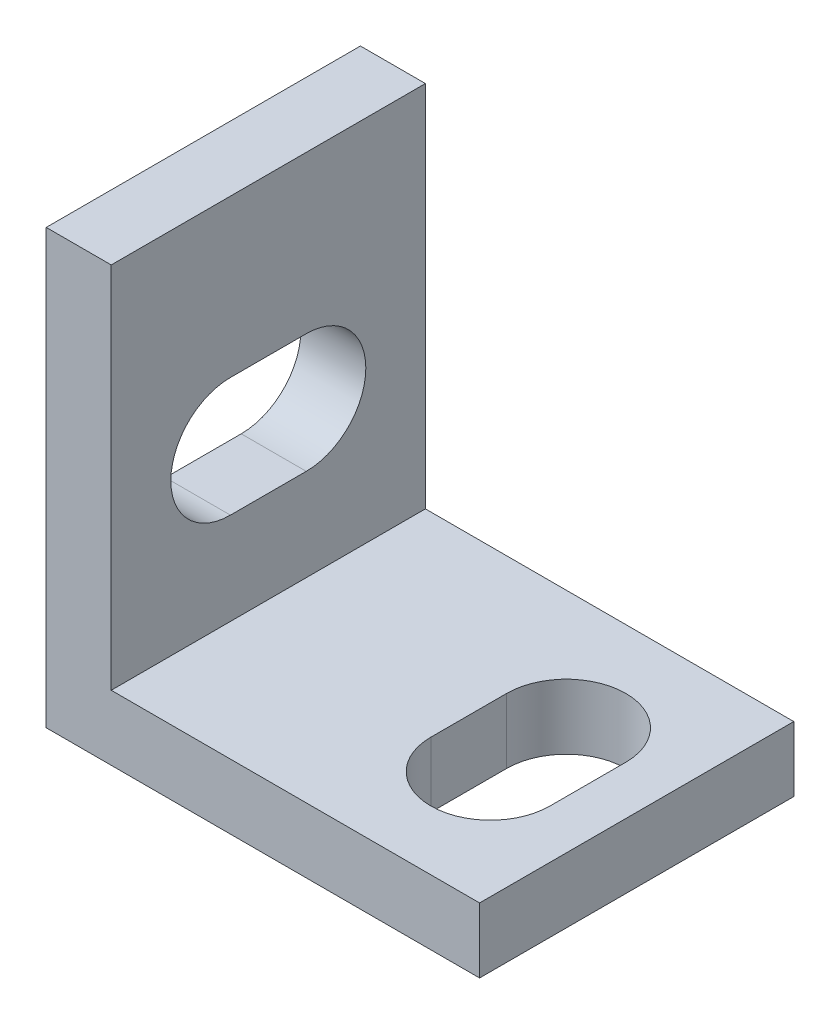
ISO-10303-21;
HEADER;
FILE_DESCRIPTION(('STEP AP214'),'2;1');
FILE_NAME('part.step','',(''),(''),'','','');
FILE_SCHEMA(('AUTOMOTIVE_DESIGN { 1 0 10303 214 1 1 1 1 }'));
ENDSEC;
DATA;
#1=APPLICATION_CONTEXT('core data for automotive mechanical design processes');
#2=APPLICATION_PROTOCOL_DEFINITION('international standard','automotive_design',2000,#1);
#3=PRODUCT_CONTEXT('',#1,'mechanical');
#4=PRODUCT('Part','Part','',(#3));
#5=PRODUCT_RELATED_PRODUCT_CATEGORY('part','',(#4));
#6=PRODUCT_DEFINITION_FORMATION('','',#4);
#7=PRODUCT_DEFINITION_CONTEXT('part definition',#1,'design');
#8=PRODUCT_DEFINITION('design','',#6,#7);
#9=PRODUCT_DEFINITION_SHAPE('','',#8);
#10=(LENGTH_UNIT() NAMED_UNIT(*) SI_UNIT(.MILLI.,.METRE.));
#11=(NAMED_UNIT(*) PLANE_ANGLE_UNIT() SI_UNIT($,.RADIAN.));
#12=(NAMED_UNIT(*) SI_UNIT($,.STERADIAN.) SOLID_ANGLE_UNIT());
#13=UNCERTAINTY_MEASURE_WITH_UNIT(LENGTH_MEASURE(1.E-05),#10,'distance_accuracy_value','');
#14=(GEOMETRIC_REPRESENTATION_CONTEXT(3) GLOBAL_UNCERTAINTY_ASSIGNED_CONTEXT((#13)) GLOBAL_UNIT_ASSIGNED_CONTEXT((#10,
#11,#12)) REPRESENTATION_CONTEXT('',''));
#15=CARTESIAN_POINT('',(0.,0.,0.));
#16=DIRECTION('',(0.,0.,1.));
#17=DIRECTION('',(1.,0.,0.));
#18=AXIS2_PLACEMENT_3D('',#15,#16,#17);
#19=CARTESIAN_POINT('',(0.,0.,14.5));
#20=DIRECTION('',(0.,1.,0.));
#21=DIRECTION('',(0.,0.,1.));
#22=AXIS2_PLACEMENT_3D('',#19,#20,#21);
#23=PLANE('',#22);
#24=DIRECTION('',(0.,0.,1.));
#25=VECTOR('',#24,1.);
#26=CARTESIAN_POINT('',(12.25,0.,9.00000000000001));
#27=LINE('',#26,#25);
#28=CARTESIAN_POINT('',(12.25,0.,5.50000000000001));
#29=VERTEX_POINT('',#28);
#30=CARTESIAN_POINT('',(12.25,0.,9.00000000000001));
#31=VERTEX_POINT('',#30);
#32=EDGE_CURVE('E141',#29,#31,#27,.T.);
#33=ORIENTED_EDGE('',*,*,#32,.T.);
#34=CARTESIAN_POINT('',(15.,0.,9.00000000000001));
#35=DIRECTION('',(0.,1.,0.));
#36=DIRECTION('',(0.,0.,1.));
#37=AXIS2_PLACEMENT_3D('',#34,#35,#36);
#38=CIRCLE('',#37,2.75);
#39=CARTESIAN_POINT('',(17.75,0.,9.00000000000001));
#40=VERTEX_POINT('',#39);
#41=EDGE_CURVE('E135',#31,#40,#38,.T.);
#42=ORIENTED_EDGE('',*,*,#41,.T.);
#43=DIRECTION('',(0.,0.,-1.));
#44=VECTOR('',#43,1.);
#45=CARTESIAN_POINT('',(17.75,0.,9.00000000000001));
#46=LINE('',#45,#44);
#47=CARTESIAN_POINT('',(17.75,0.,5.50000000000001));
#48=VERTEX_POINT('',#47);
#49=EDGE_CURVE('E144',#40,#48,#46,.T.);
#50=ORIENTED_EDGE('',*,*,#49,.T.);
#51=CARTESIAN_POINT('',(15.,0.,5.50000000000001));
#52=DIRECTION('',(0.,1.,0.));
#53=DIRECTION('',(0.,0.,1.));
#54=AXIS2_PLACEMENT_3D('',#51,#52,#53);
#55=CIRCLE('',#54,2.75);
#56=EDGE_CURVE('E48',#48,#29,#55,.T.);
#57=ORIENTED_EDGE('',*,*,#56,.T.);
#58=EDGE_LOOP('',(#33,#42,#50,#57));
#59=FACE_BOUND('',#58,.T.);
#60=DIRECTION('',(1.,0.,0.));
#61=VECTOR('',#60,1.);
#62=CARTESIAN_POINT('',(0.,0.,0.));
#63=LINE('',#62,#61);
#64=CARTESIAN_POINT('',(0.,0.,0.));
#65=VERTEX_POINT('',#64);
#66=CARTESIAN_POINT('',(20.,0.,0.));
#67=VERTEX_POINT('',#66);
#68=EDGE_CURVE('E194',#65,#67,#63,.T.);
#69=ORIENTED_EDGE('',*,*,#68,.T.);
#70=DIRECTION('',(0.,0.,-1.));
#71=VECTOR('',#70,1.);
#72=CARTESIAN_POINT('',(20.,0.,14.5));
#73=LINE('',#72,#71);
#74=CARTESIAN_POINT('',(20.,0.,14.5));
#75=VERTEX_POINT('',#74);
#76=EDGE_CURVE('E11',#75,#67,#73,.T.);
#77=ORIENTED_EDGE('',*,*,#76,.F.);
#78=DIRECTION('',(1.,0.,0.));
#79=VECTOR('',#78,1.);
#80=CARTESIAN_POINT('',(0.,0.,14.5));
#81=LINE('',#80,#79);
#82=CARTESIAN_POINT('',(0.,0.,14.5));
#83=VERTEX_POINT('',#82);
#84=EDGE_CURVE('E201',#83,#75,#81,.T.);
#85=ORIENTED_EDGE('',*,*,#84,.F.);
#86=DIRECTION('',(0.,0.,-1.));
#87=VECTOR('',#86,1.);
#88=CARTESIAN_POINT('',(0.,0.,14.5));
#89=LINE('',#88,#87);
#90=EDGE_CURVE('E218',#83,#65,#89,.T.);
#91=ORIENTED_EDGE('',*,*,#90,.T.);
#92=EDGE_LOOP('',(#69,#77,#85,#91));
#93=FACE_BOUND('',#92,.T.);
#94=ADVANCED_FACE('F34',(#59,#93),#23,.F.);
#95=CARTESIAN_POINT('',(20.,3.,14.5));
#96=DIRECTION('',(1.,0.,0.));
#97=DIRECTION('',(0.,0.,-1.));
#98=AXIS2_PLACEMENT_3D('',#95,#96,#97);
#99=PLANE('',#98);
#100=DIRECTION('',(0.,-1.,0.));
#101=VECTOR('',#100,1.);
#102=CARTESIAN_POINT('',(20.,3.,0.));
#103=LINE('',#102,#101);
#104=CARTESIAN_POINT('',(20.,3.,0.));
#105=VERTEX_POINT('',#104);
#106=EDGE_CURVE('E221',#105,#67,#103,.T.);
#107=ORIENTED_EDGE('',*,*,#106,.F.);
#108=DIRECTION('',(0.,0.,-1.));
#109=VECTOR('',#108,1.);
#110=CARTESIAN_POINT('',(20.,3.,14.5));
#111=LINE('',#110,#109);
#112=CARTESIAN_POINT('',(20.,3.,14.5));
#113=VERTEX_POINT('',#112);
#114=EDGE_CURVE('E41',#113,#105,#111,.T.);
#115=ORIENTED_EDGE('',*,*,#114,.F.);
#116=DIRECTION('',(0.,-1.,0.));
#117=VECTOR('',#116,1.);
#118=CARTESIAN_POINT('',(20.,3.,14.5));
#119=LINE('',#118,#117);
#120=EDGE_CURVE('E203',#113,#75,#119,.T.);
#121=ORIENTED_EDGE('',*,*,#120,.T.);
#122=ORIENTED_EDGE('',*,*,#76,.T.);
#123=EDGE_LOOP('',(#107,#115,#121,#122));
#124=FACE_BOUND('',#123,.T.);
#125=ADVANCED_FACE('F248',(#124),#99,.T.);
#126=CARTESIAN_POINT('',(0.,3.,14.5));
#127=DIRECTION('',(0.,1.,0.));
#128=DIRECTION('',(0.,0.,1.));
#129=AXIS2_PLACEMENT_3D('',#126,#127,#128);
#130=PLANE('',#129);
#131=CARTESIAN_POINT('',(15.,3.,9.00000000000001));
#132=DIRECTION('',(0.,1.,0.));
#133=DIRECTION('',(0.,0.,1.));
#134=AXIS2_PLACEMENT_3D('',#131,#132,#133);
#135=CIRCLE('',#134,2.75);
#136=CARTESIAN_POINT('',(12.25,3.,9.00000000000001));
#137=VERTEX_POINT('',#136);
#138=CARTESIAN_POINT('',(17.75,3.,9.00000000000001));
#139=VERTEX_POINT('',#138);
#140=EDGE_CURVE('E56',#137,#139,#135,.T.);
#141=ORIENTED_EDGE('',*,*,#140,.F.);
#142=DIRECTION('',(0.,0.,1.));
#143=VECTOR('',#142,1.);
#144=CARTESIAN_POINT('',(12.25,3.,9.00000000000001));
#145=LINE('',#144,#143);
#146=CARTESIAN_POINT('',(12.25,3.,5.50000000000001));
#147=VERTEX_POINT('',#146);
#148=EDGE_CURVE('E150',#147,#137,#145,.T.);
#149=ORIENTED_EDGE('',*,*,#148,.F.);
#150=CARTESIAN_POINT('',(15.,3.,5.50000000000001));
#151=DIRECTION('',(0.,1.,0.));
#152=DIRECTION('',(0.,0.,1.));
#153=AXIS2_PLACEMENT_3D('',#150,#151,#152);
#154=CIRCLE('',#153,2.75);
#155=CARTESIAN_POINT('',(17.75,3.,5.50000000000001));
#156=VERTEX_POINT('',#155);
#157=EDGE_CURVE('E153',#156,#147,#154,.T.);
#158=ORIENTED_EDGE('',*,*,#157,.F.);
#159=DIRECTION('',(0.,0.,-1.));
#160=VECTOR('',#159,1.);
#161=CARTESIAN_POINT('',(17.75,3.,9.00000000000001));
#162=LINE('',#161,#160);
#163=EDGE_CURVE('E159',#139,#156,#162,.T.);
#164=ORIENTED_EDGE('',*,*,#163,.F.);
#165=EDGE_LOOP('',(#141,#149,#158,#164));
#166=FACE_BOUND('',#165,.T.);
#167=DIRECTION('',(1.,0.,0.));
#168=VECTOR('',#167,1.);
#169=CARTESIAN_POINT('',(0.,3.,0.));
#170=LINE('',#169,#168);
#171=CARTESIAN_POINT('',(3.,3.,0.));
#172=VERTEX_POINT('',#171);
#173=EDGE_CURVE('E224',#172,#105,#170,.T.);
#174=ORIENTED_EDGE('',*,*,#173,.F.);
#175=DIRECTION('',(0.,0.,-1.));
#176=VECTOR('',#175,1.);
#177=CARTESIAN_POINT('',(3.,3.,14.5));
#178=LINE('',#177,#176);
#179=CARTESIAN_POINT('',(3.,3.,14.5));
#180=VERTEX_POINT('',#179);
#181=EDGE_CURVE('E240',#180,#172,#178,.T.);
#182=ORIENTED_EDGE('',*,*,#181,.F.);
#183=DIRECTION('',(1.,0.,0.));
#184=VECTOR('',#183,1.);
#185=CARTESIAN_POINT('',(0.,3.,14.5));
#186=LINE('',#185,#184);
#187=EDGE_CURVE('E207',#180,#113,#186,.T.);
#188=ORIENTED_EDGE('',*,*,#187,.T.);
#189=ORIENTED_EDGE('',*,*,#114,.T.);
#190=EDGE_LOOP('',(#174,#182,#188,#189));
#191=FACE_BOUND('',#190,.T.);
#192=ADVANCED_FACE('F244',(#166,#191),#130,.T.);
#193=CARTESIAN_POINT('',(3.,20.,14.5));
#194=DIRECTION('',(1.,0.,0.));
#195=DIRECTION('',(0.,0.,-1.));
#196=AXIS2_PLACEMENT_3D('',#193,#194,#195);
#197=PLANE('',#196);
#198=CARTESIAN_POINT('',(3.,10.,5.50000000000001));
#199=DIRECTION('',(1.,0.,0.));
#200=DIRECTION('',(0.,0.,-1.));
#201=AXIS2_PLACEMENT_3D('',#198,#199,#200);
#202=CIRCLE('',#201,2.75);
#203=CARTESIAN_POINT('',(3.,7.25000000000001,5.50000000000001));
#204=VERTEX_POINT('',#203);
#205=CARTESIAN_POINT('',(3.,12.75,5.50000000000001));
#206=VERTEX_POINT('',#205);
#207=EDGE_CURVE('E165',#204,#206,#202,.T.);
#208=ORIENTED_EDGE('',*,*,#207,.F.);
#209=DIRECTION('',(0.,0.,-1.));
#210=VECTOR('',#209,1.);
#211=CARTESIAN_POINT('',(3.,7.25000000000001,5.50000000000001));
#212=LINE('',#211,#210);
#213=CARTESIAN_POINT('',(3.,7.25000000000001,9.00000000000001));
#214=VERTEX_POINT('',#213);
#215=EDGE_CURVE('E173',#214,#204,#212,.T.);
#216=ORIENTED_EDGE('',*,*,#215,.F.);
#217=CARTESIAN_POINT('',(3.,10.,9.00000000000001));
#218=DIRECTION('',(1.,0.,0.));
#219=DIRECTION('',(0.,0.,-1.));
#220=AXIS2_PLACEMENT_3D('',#217,#218,#219);
#221=CIRCLE('',#220,2.75);
#222=CARTESIAN_POINT('',(3.,12.75,9.00000000000001));
#223=VERTEX_POINT('',#222);
#224=EDGE_CURVE('E187',#223,#214,#221,.T.);
#225=ORIENTED_EDGE('',*,*,#224,.F.);
#226=DIRECTION('',(0.,0.,1.));
#227=VECTOR('',#226,1.);
#228=CARTESIAN_POINT('',(3.,12.75,5.50000000000001));
#229=LINE('',#228,#227);
#230=EDGE_CURVE('E184',#206,#223,#229,.T.);
#231=ORIENTED_EDGE('',*,*,#230,.F.);
#232=EDGE_LOOP('',(#208,#216,#225,#231));
#233=FACE_BOUND('',#232,.T.);
#234=DIRECTION('',(0.,1.,0.));
#235=VECTOR('',#234,1.);
#236=CARTESIAN_POINT('',(3.,20.,0.));
#237=LINE('',#236,#235);
#238=CARTESIAN_POINT('',(3.,20.,0.));
#239=VERTEX_POINT('',#238);
#240=EDGE_CURVE('E227',#239,#172,#237,.F.);
#241=ORIENTED_EDGE('',*,*,#240,.F.);
#242=DIRECTION('',(0.,0.,-1.));
#243=VECTOR('',#242,1.);
#244=CARTESIAN_POINT('',(3.,20.,14.5));
#245=LINE('',#244,#243);
#246=CARTESIAN_POINT('',(3.,20.,14.5));
#247=VERTEX_POINT('',#246);
#248=EDGE_CURVE('E238',#247,#239,#245,.T.);
#249=ORIENTED_EDGE('',*,*,#248,.F.);
#250=DIRECTION('',(0.,1.,0.));
#251=VECTOR('',#250,1.);
#252=CARTESIAN_POINT('',(3.,20.,14.5));
#253=LINE('',#252,#251);
#254=EDGE_CURVE('E210',#247,#180,#253,.F.);
#255=ORIENTED_EDGE('',*,*,#254,.T.);
#256=ORIENTED_EDGE('',*,*,#181,.T.);
#257=EDGE_LOOP('',(#241,#249,#255,#256));
#258=FACE_BOUND('',#257,.T.);
#259=ADVANCED_FACE('F257',(#233,#258),#197,.T.);
#260=CARTESIAN_POINT('',(0.,20.,14.5));
#261=DIRECTION('',(0.,1.,0.));
#262=DIRECTION('',(0.,0.,1.));
#263=AXIS2_PLACEMENT_3D('',#260,#261,#262);
#264=PLANE('',#263);
#265=DIRECTION('',(1.,0.,0.));
#266=VECTOR('',#265,1.);
#267=CARTESIAN_POINT('',(0.,20.,0.));
#268=LINE('',#267,#266);
#269=CARTESIAN_POINT('',(0.,20.,0.));
#270=VERTEX_POINT('',#269);
#271=EDGE_CURVE('E230',#270,#239,#268,.T.);
#272=ORIENTED_EDGE('',*,*,#271,.F.);
#273=DIRECTION('',(0.,0.,-1.));
#274=VECTOR('',#273,1.);
#275=CARTESIAN_POINT('',(0.,20.,14.5));
#276=LINE('',#275,#274);
#277=CARTESIAN_POINT('',(0.,20.,14.5));
#278=VERTEX_POINT('',#277);
#279=EDGE_CURVE('E236',#278,#270,#276,.T.);
#280=ORIENTED_EDGE('',*,*,#279,.F.);
#281=DIRECTION('',(1.,0.,0.));
#282=VECTOR('',#281,1.);
#283=CARTESIAN_POINT('',(0.,20.,14.5));
#284=LINE('',#283,#282);
#285=EDGE_CURVE('E213',#278,#247,#284,.T.);
#286=ORIENTED_EDGE('',*,*,#285,.T.);
#287=ORIENTED_EDGE('',*,*,#248,.T.);
#288=EDGE_LOOP('',(#272,#280,#286,#287));
#289=FACE_BOUND('',#288,.T.);
#290=ADVANCED_FACE('F267',(#289),#264,.T.);
#291=CARTESIAN_POINT('',(0.,20.,14.5));
#292=DIRECTION('',(1.,0.,0.));
#293=DIRECTION('',(0.,0.,-1.));
#294=AXIS2_PLACEMENT_3D('',#291,#292,#293);
#295=PLANE('',#294);
#296=DIRECTION('',(0.,0.,-1.));
#297=VECTOR('',#296,1.);
#298=CARTESIAN_POINT('',(0.,7.25000000000001,5.50000000000001));
#299=LINE('',#298,#297);
#300=CARTESIAN_POINT('',(0.,7.25000000000001,9.00000000000001));
#301=VERTEX_POINT('',#300);
#302=CARTESIAN_POINT('',(0.,7.25000000000001,5.50000000000001));
#303=VERTEX_POINT('',#302);
#304=EDGE_CURVE('E179',#301,#303,#299,.T.);
#305=ORIENTED_EDGE('',*,*,#304,.T.);
#306=CARTESIAN_POINT('',(0.,10.,5.50000000000001));
#307=DIRECTION('',(1.,0.,0.));
#308=DIRECTION('',(0.,0.,-1.));
#309=AXIS2_PLACEMENT_3D('',#306,#307,#308);
#310=CIRCLE('',#309,2.75);
#311=CARTESIAN_POINT('',(0.,12.75,5.50000000000001));
#312=VERTEX_POINT('',#311);
#313=EDGE_CURVE('E169',#303,#312,#310,.T.);
#314=ORIENTED_EDGE('',*,*,#313,.T.);
#315=DIRECTION('',(0.,0.,1.));
#316=VECTOR('',#315,1.);
#317=CARTESIAN_POINT('',(0.,12.75,5.50000000000001));
#318=LINE('',#317,#316);
#319=CARTESIAN_POINT('',(0.,12.75,9.00000000000001));
#320=VERTEX_POINT('',#319);
#321=EDGE_CURVE('E172',#312,#320,#318,.T.);
#322=ORIENTED_EDGE('',*,*,#321,.T.);
#323=CARTESIAN_POINT('',(0.,10.,9.00000000000001));
#324=DIRECTION('',(1.,0.,0.));
#325=DIRECTION('',(0.,0.,-1.));
#326=AXIS2_PLACEMENT_3D('',#323,#324,#325);
#327=CIRCLE('',#326,2.75);
#328=EDGE_CURVE('E176',#320,#301,#327,.T.);
#329=ORIENTED_EDGE('',*,*,#328,.T.);
#330=EDGE_LOOP('',(#305,#314,#322,#329));
#331=FACE_BOUND('',#330,.T.);
#332=DIRECTION('',(0.,-1.,0.));
#333=VECTOR('',#332,1.);
#334=CARTESIAN_POINT('',(0.,20.,0.));
#335=LINE('',#334,#333);
#336=EDGE_CURVE('E204',#270,#65,#335,.T.);
#337=ORIENTED_EDGE('',*,*,#336,.T.);
#338=ORIENTED_EDGE('',*,*,#90,.F.);
#339=DIRECTION('',(0.,-1.,0.));
#340=VECTOR('',#339,1.);
#341=CARTESIAN_POINT('',(0.,20.,14.5));
#342=LINE('',#341,#340);
#343=EDGE_CURVE('E216',#278,#83,#342,.T.);
#344=ORIENTED_EDGE('',*,*,#343,.F.);
#345=ORIENTED_EDGE('',*,*,#279,.T.);
#346=EDGE_LOOP('',(#337,#338,#344,#345));
#347=FACE_BOUND('',#346,.T.);
#348=ADVANCED_FACE('F268',(#331,#347),#295,.F.);
#349=CARTESIAN_POINT('',(0.,0.,14.5));
#350=DIRECTION('',(0.,0.,-1.));
#351=DIRECTION('',(-1.,0.,0.));
#352=AXIS2_PLACEMENT_3D('',#349,#350,#351);
#353=PLANE('',#352);
#354=ORIENTED_EDGE('',*,*,#84,.T.);
#355=ORIENTED_EDGE('',*,*,#120,.F.);
#356=ORIENTED_EDGE('',*,*,#187,.F.);
#357=ORIENTED_EDGE('',*,*,#254,.F.);
#358=ORIENTED_EDGE('',*,*,#285,.F.);
#359=ORIENTED_EDGE('',*,*,#343,.T.);
#360=EDGE_LOOP('',(#354,#355,#356,#357,#358,#359));
#361=FACE_BOUND('',#360,.T.);
#362=ADVANCED_FACE('F260',(#361),#353,.F.);
#363=CARTESIAN_POINT('',(0.,0.,0.));
#364=DIRECTION('',(0.,0.,-1.));
#365=DIRECTION('',(-1.,0.,0.));
#366=AXIS2_PLACEMENT_3D('',#363,#364,#365);
#367=PLANE('',#366);
#368=ORIENTED_EDGE('',*,*,#68,.F.);
#369=ORIENTED_EDGE('',*,*,#336,.F.);
#370=ORIENTED_EDGE('',*,*,#271,.T.);
#371=ORIENTED_EDGE('',*,*,#240,.T.);
#372=ORIENTED_EDGE('',*,*,#173,.T.);
#373=ORIENTED_EDGE('',*,*,#106,.T.);
#374=EDGE_LOOP('',(#368,#369,#370,#371,#372,#373));
#375=FACE_BOUND('',#374,.T.);
#376=ADVANCED_FACE('F252',(#375),#367,.T.);
#377=CARTESIAN_POINT('',(0.,10.,5.50000000000001));
#378=DIRECTION('',(1.,0.,0.));
#379=DIRECTION('',(0.,0.,-1.));
#380=AXIS2_PLACEMENT_3D('',#377,#378,#379);
#381=CYLINDRICAL_SURFACE('',#380,2.75);
#382=ORIENTED_EDGE('',*,*,#207,.T.);
#383=DIRECTION('',(1.,0.,0.));
#384=VECTOR('',#383,1.);
#385=CARTESIAN_POINT('',(0.,12.75,5.50000000000001));
#386=LINE('',#385,#384);
#387=EDGE_CURVE('E182',#312,#206,#386,.T.);
#388=ORIENTED_EDGE('',*,*,#387,.F.);
#389=ORIENTED_EDGE('',*,*,#313,.F.);
#390=DIRECTION('',(1.,0.,0.));
#391=VECTOR('',#390,1.);
#392=CARTESIAN_POINT('',(0.,7.25000000000001,5.50000000000001));
#393=LINE('',#392,#391);
#394=EDGE_CURVE('E192',#303,#204,#393,.T.);
#395=ORIENTED_EDGE('',*,*,#394,.T.);
#396=EDGE_LOOP('',(#382,#388,#389,#395));
#397=FACE_BOUND('',#396,.T.);
#398=ADVANCED_FACE('F298',(#397),#381,.F.);
#399=CARTESIAN_POINT('',(0.,7.25000000000001,5.50000000000001));
#400=DIRECTION('',(0.,-1.,0.));
#401=DIRECTION('',(0.,0.,-1.));
#402=AXIS2_PLACEMENT_3D('',#399,#400,#401);
#403=PLANE('',#402);
#404=ORIENTED_EDGE('',*,*,#215,.T.);
#405=ORIENTED_EDGE('',*,*,#394,.F.);
#406=ORIENTED_EDGE('',*,*,#304,.F.);
#407=DIRECTION('',(1.,0.,0.));
#408=VECTOR('',#407,1.);
#409=CARTESIAN_POINT('',(0.,7.25000000000001,9.00000000000001));
#410=LINE('',#409,#408);
#411=EDGE_CURVE('E195',#301,#214,#410,.T.);
#412=ORIENTED_EDGE('',*,*,#411,.T.);
#413=EDGE_LOOP('',(#404,#405,#406,#412));
#414=FACE_BOUND('',#413,.T.);
#415=ADVANCED_FACE('F306',(#414),#403,.F.);
#416=CARTESIAN_POINT('',(0.,10.,9.00000000000001));
#417=DIRECTION('',(1.,0.,0.));
#418=DIRECTION('',(0.,0.,-1.));
#419=AXIS2_PLACEMENT_3D('',#416,#417,#418);
#420=CYLINDRICAL_SURFACE('',#419,2.75);
#421=ORIENTED_EDGE('',*,*,#224,.T.);
#422=ORIENTED_EDGE('',*,*,#411,.F.);
#423=ORIENTED_EDGE('',*,*,#328,.F.);
#424=DIRECTION('',(1.,0.,0.));
#425=VECTOR('',#424,1.);
#426=CARTESIAN_POINT('',(0.,12.75,9.00000000000001));
#427=LINE('',#426,#425);
#428=EDGE_CURVE('E197',#320,#223,#427,.T.);
#429=ORIENTED_EDGE('',*,*,#428,.T.);
#430=EDGE_LOOP('',(#421,#422,#423,#429));
#431=FACE_BOUND('',#430,.T.);
#432=ADVANCED_FACE('F308',(#431),#420,.F.);
#433=CARTESIAN_POINT('',(0.,12.75,5.50000000000001));
#434=DIRECTION('',(0.,1.,0.));
#435=DIRECTION('',(0.,0.,1.));
#436=AXIS2_PLACEMENT_3D('',#433,#434,#435);
#437=PLANE('',#436);
#438=ORIENTED_EDGE('',*,*,#230,.T.);
#439=ORIENTED_EDGE('',*,*,#428,.F.);
#440=ORIENTED_EDGE('',*,*,#321,.F.);
#441=ORIENTED_EDGE('',*,*,#387,.T.);
#442=EDGE_LOOP('',(#438,#439,#440,#441));
#443=FACE_BOUND('',#442,.T.);
#444=ADVANCED_FACE('F302',(#443),#437,.F.);
#445=CARTESIAN_POINT('',(15.,0.,9.00000000000001));
#446=DIRECTION('',(0.,1.,0.));
#447=DIRECTION('',(0.,0.,1.));
#448=AXIS2_PLACEMENT_3D('',#445,#446,#447);
#449=CYLINDRICAL_SURFACE('',#448,2.75);
#450=ORIENTED_EDGE('',*,*,#140,.T.);
#451=DIRECTION('',(0.,1.,0.));
#452=VECTOR('',#451,1.);
#453=CARTESIAN_POINT('',(17.75,0.,9.00000000000001));
#454=LINE('',#453,#452);
#455=EDGE_CURVE('E131',#40,#139,#454,.T.);
#456=ORIENTED_EDGE('',*,*,#455,.F.);
#457=ORIENTED_EDGE('',*,*,#41,.F.);
#458=DIRECTION('',(0.,1.,0.));
#459=VECTOR('',#458,1.);
#460=CARTESIAN_POINT('',(12.25,0.,9.00000000000001));
#461=LINE('',#460,#459);
#462=EDGE_CURVE('E163',#31,#137,#461,.T.);
#463=ORIENTED_EDGE('',*,*,#462,.T.);
#464=EDGE_LOOP('',(#450,#456,#457,#463));
#465=FACE_BOUND('',#464,.T.);
#466=ADVANCED_FACE('F133',(#465),#449,.F.);
#467=CARTESIAN_POINT('',(12.25,0.,9.00000000000001));
#468=DIRECTION('',(-1.,0.,0.));
#469=DIRECTION('',(0.,0.,1.));
#470=AXIS2_PLACEMENT_3D('',#467,#468,#469);
#471=PLANE('',#470);
#472=ORIENTED_EDGE('',*,*,#148,.T.);
#473=ORIENTED_EDGE('',*,*,#462,.F.);
#474=ORIENTED_EDGE('',*,*,#32,.F.);
#475=DIRECTION('',(0.,1.,0.));
#476=VECTOR('',#475,1.);
#477=CARTESIAN_POINT('',(12.25,0.,5.50000000000001));
#478=LINE('',#477,#476);
#479=EDGE_CURVE('E166',#29,#147,#478,.T.);
#480=ORIENTED_EDGE('',*,*,#479,.T.);
#481=EDGE_LOOP('',(#472,#473,#474,#480));
#482=FACE_BOUND('',#481,.T.);
#483=ADVANCED_FACE('F346',(#482),#471,.F.);
#484=CARTESIAN_POINT('',(15.,0.,5.50000000000001));
#485=DIRECTION('',(0.,1.,0.));
#486=DIRECTION('',(0.,0.,1.));
#487=AXIS2_PLACEMENT_3D('',#484,#485,#486);
#488=CYLINDRICAL_SURFACE('',#487,2.75);
#489=ORIENTED_EDGE('',*,*,#157,.T.);
#490=ORIENTED_EDGE('',*,*,#479,.F.);
#491=ORIENTED_EDGE('',*,*,#56,.F.);
#492=DIRECTION('',(0.,1.,0.));
#493=VECTOR('',#492,1.);
#494=CARTESIAN_POINT('',(17.75,0.,5.50000000000001));
#495=LINE('',#494,#493);
#496=EDGE_CURVE('E140',#48,#156,#495,.T.);
#497=ORIENTED_EDGE('',*,*,#496,.T.);
#498=EDGE_LOOP('',(#489,#490,#491,#497));
#499=FACE_BOUND('',#498,.T.);
#500=ADVANCED_FACE('F352',(#499),#488,.F.);
#501=CARTESIAN_POINT('',(17.75,0.,9.00000000000001));
#502=DIRECTION('',(1.,0.,0.));
#503=DIRECTION('',(0.,0.,-1.));
#504=AXIS2_PLACEMENT_3D('',#501,#502,#503);
#505=PLANE('',#504);
#506=ORIENTED_EDGE('',*,*,#163,.T.);
#507=ORIENTED_EDGE('',*,*,#496,.F.);
#508=ORIENTED_EDGE('',*,*,#49,.F.);
#509=ORIENTED_EDGE('',*,*,#455,.T.);
#510=EDGE_LOOP('',(#506,#507,#508,#509));
#511=FACE_BOUND('',#510,.T.);
#512=ADVANCED_FACE('F145',(#511),#505,.F.);
#513=CLOSED_SHELL('',(#94,#125,#192,#259,#290,#348,#362,#376,#398,#415,#432,#444,#466,#483,#500,#512));
#514=MANIFOLD_SOLID_BREP('B2',#513);
#515=ADVANCED_BREP_SHAPE_REPRESENTATION('',(#18,#514),#14);
#516=SHAPE_DEFINITION_REPRESENTATION(#9,#515);
ENDSEC;
END-ISO-10303-21;
